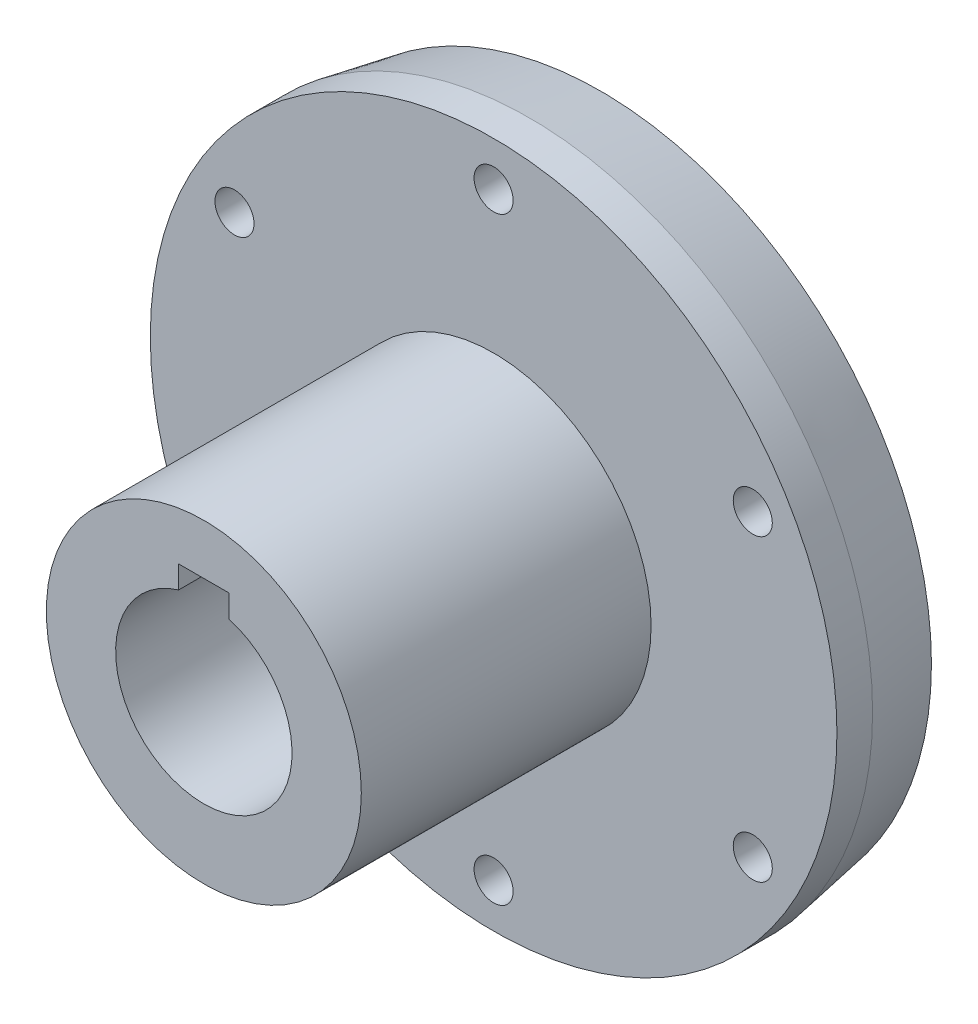
ISO-10303-21;
HEADER;
FILE_DESCRIPTION(('STEP AP214'),'2;1');
FILE_NAME('part.step','',(''),(''),'','','');
FILE_SCHEMA(('AUTOMOTIVE_DESIGN { 1 0 10303 214 1 1 1 1 }'));
ENDSEC;
DATA;
#1=APPLICATION_CONTEXT('core data for automotive mechanical design processes');
#2=APPLICATION_PROTOCOL_DEFINITION('international standard','automotive_design',2000,#1);
#3=PRODUCT_CONTEXT('',#1,'mechanical');
#4=PRODUCT('Part','Part','',(#3));
#5=PRODUCT_RELATED_PRODUCT_CATEGORY('part','',(#4));
#6=PRODUCT_DEFINITION_FORMATION('','',#4);
#7=PRODUCT_DEFINITION_CONTEXT('part definition',#1,'design');
#8=PRODUCT_DEFINITION('design','',#6,#7);
#9=PRODUCT_DEFINITION_SHAPE('','',#8);
#10=(LENGTH_UNIT() NAMED_UNIT(*) SI_UNIT(.MILLI.,.METRE.));
#11=(NAMED_UNIT(*) PLANE_ANGLE_UNIT() SI_UNIT($,.RADIAN.));
#12=(NAMED_UNIT(*) SI_UNIT($,.STERADIAN.) SOLID_ANGLE_UNIT());
#13=UNCERTAINTY_MEASURE_WITH_UNIT(LENGTH_MEASURE(1.E-05),#10,'distance_accuracy_value','');
#14=(GEOMETRIC_REPRESENTATION_CONTEXT(3) GLOBAL_UNCERTAINTY_ASSIGNED_CONTEXT((#13)) GLOBAL_UNIT_ASSIGNED_CONTEXT((#10,
#11,#12)) REPRESENTATION_CONTEXT('',''));
#15=CARTESIAN_POINT('',(0.,0.,0.));
#16=DIRECTION('',(0.,0.,1.));
#17=DIRECTION('',(1.,0.,0.));
#18=AXIS2_PLACEMENT_3D('',#15,#16,#17);
#19=CARTESIAN_POINT('',(0.,0.,17.));
#20=DIRECTION('',(0.,0.,1.));
#21=DIRECTION('',(1.,0.,0.));
#22=AXIS2_PLACEMENT_3D('',#19,#20,#21);
#23=PLANE('',#22);
#24=CARTESIAN_POINT('',(-4.03845944924067E-12,-47.5,17.));
#25=DIRECTION('',(0.,0.,1.));
#26=DIRECTION('',(1.,0.,0.));
#27=AXIS2_PLACEMENT_3D('',#24,#25,#26);
#28=CIRCLE('',#27,3.10000000000418);
#29=CARTESIAN_POINT('',(3.10000000000014,-47.5,17.));
#30=VERTEX_POINT('',#29);
#31=EDGE_CURVE('E234',#30,#30,#28,.T.);
#32=ORIENTED_EDGE('',*,*,#31,.F.);
#33=EDGE_LOOP('',(#32));
#34=FACE_BOUND('',#33,.T.);
#35=CARTESIAN_POINT('',(41.1362066797578,-23.7500000000018,17.));
#36=DIRECTION('',(0.,0.,1.));
#37=DIRECTION('',(1.,0.,0.));
#38=AXIS2_PLACEMENT_3D('',#35,#36,#37);
#39=CIRCLE('',#38,3.10000000000383);
#40=CARTESIAN_POINT('',(44.2362066797616,-23.7500000000018,17.));
#41=VERTEX_POINT('',#40);
#42=EDGE_CURVE('E230',#41,#41,#39,.T.);
#43=ORIENTED_EDGE('',*,*,#42,.F.);
#44=EDGE_LOOP('',(#43));
#45=FACE_BOUND('',#44,.T.);
#46=CARTESIAN_POINT('',(41.1362066797598,23.7499999999982,17.));
#47=DIRECTION('',(0.,0.,1.));
#48=DIRECTION('',(1.,0.,0.));
#49=AXIS2_PLACEMENT_3D('',#46,#47,#48);
#50=CIRCLE('',#49,3.10000000000204);
#51=CARTESIAN_POINT('',(44.2362066797619,23.7499999999982,17.));
#52=VERTEX_POINT('',#51);
#53=EDGE_CURVE('E226',#52,#52,#50,.T.);
#54=ORIENTED_EDGE('',*,*,#53,.F.);
#55=EDGE_LOOP('',(#54));
#56=FACE_BOUND('',#55,.T.);
#57=CARTESIAN_POINT('',(-41.1362066797639,-23.7499999999982,17.));
#58=DIRECTION('',(0.,0.,1.));
#59=DIRECTION('',(1.,0.,0.));
#60=AXIS2_PLACEMENT_3D('',#57,#58,#59);
#61=CIRCLE('',#60,3.10000000000261);
#62=CARTESIAN_POINT('',(-38.0362066797613,-23.7499999999982,17.));
#63=VERTEX_POINT('',#62);
#64=EDGE_CURVE('E222',#63,#63,#61,.T.);
#65=ORIENTED_EDGE('',*,*,#64,.F.);
#66=EDGE_LOOP('',(#65));
#67=FACE_BOUND('',#66,.T.);
#68=CARTESIAN_POINT('',(0.,47.5,17.));
#69=DIRECTION('',(0.,0.,1.));
#70=DIRECTION('',(1.,0.,0.));
#71=AXIS2_PLACEMENT_3D('',#68,#69,#70);
#72=CIRCLE('',#71,3.1);
#73=CARTESIAN_POINT('',(3.1,47.5,17.));
#74=VERTEX_POINT('',#73);
#75=EDGE_CURVE('E218',#74,#74,#72,.T.);
#76=ORIENTED_EDGE('',*,*,#75,.F.);
#77=EDGE_LOOP('',(#76));
#78=FACE_BOUND('',#77,.T.);
#79=CARTESIAN_POINT('',(-41.1362066797618,23.7500000000018,17.));
#80=DIRECTION('',(0.,0.,1.));
#81=DIRECTION('',(1.,0.,0.));
#82=AXIS2_PLACEMENT_3D('',#79,#80,#81);
#83=CIRCLE('',#82,3.10000000000057);
#84=CARTESIAN_POINT('',(-38.0362066797613,23.7500000000018,17.));
#85=VERTEX_POINT('',#84);
#86=EDGE_CURVE('E213',#85,#85,#83,.T.);
#87=ORIENTED_EDGE('',*,*,#86,.F.);
#88=EDGE_LOOP('',(#87));
#89=FACE_BOUND('',#88,.T.);
#90=CARTESIAN_POINT('',(0.,0.,17.));
#91=DIRECTION('',(0.,0.,1.));
#92=DIRECTION('',(1.,0.,0.));
#93=AXIS2_PLACEMENT_3D('',#90,#91,#92);
#94=CIRCLE('',#93,54.5);
#95=CARTESIAN_POINT('',(54.5,0.,17.));
#96=VERTEX_POINT('',#95);
#97=EDGE_CURVE('E142',#96,#96,#94,.T.);
#98=ORIENTED_EDGE('',*,*,#97,.T.);
#99=EDGE_LOOP('',(#98));
#100=FACE_BOUND('',#99,.T.);
#101=CARTESIAN_POINT('',(0.,0.,17.));
#102=DIRECTION('',(0.,0.,1.));
#103=DIRECTION('',(1.,0.,0.));
#104=AXIS2_PLACEMENT_3D('',#101,#102,#103);
#105=CIRCLE('',#104,25.);
#106=CARTESIAN_POINT('',(25.,0.,17.));
#107=VERTEX_POINT('',#106);
#108=EDGE_CURVE('E136',#107,#107,#105,.T.);
#109=ORIENTED_EDGE('',*,*,#108,.F.);
#110=EDGE_LOOP('',(#109));
#111=FACE_BOUND('',#110,.T.);
#112=ADVANCED_FACE('F57',(#34,#45,#56,#67,#78,#89,#100,#111),#23,.T.);
#113=CARTESIAN_POINT('',(0.,0.,17.));
#114=DIRECTION('',(0.,0.,-1.));
#115=DIRECTION('',(-1.,0.,0.));
#116=AXIS2_PLACEMENT_3D('',#113,#114,#115);
#117=CYLINDRICAL_SURFACE('',#116,54.5);
#118=CARTESIAN_POINT('',(0.,0.,11.342563639235));
#119=DIRECTION('',(0.,0.,1.));
#120=DIRECTION('',(1.,0.,0.));
#121=AXIS2_PLACEMENT_3D('',#118,#119,#120);
#122=CIRCLE('',#121,54.5);
#123=CARTESIAN_POINT('',(54.5,0.,11.342563639235));
#124=VERTEX_POINT('',#123);
#125=EDGE_CURVE('E65',#124,#124,#122,.T.);
#126=ORIENTED_EDGE('',*,*,#125,.T.);
#127=EDGE_LOOP('',(#126));
#128=FACE_BOUND('',#127,.T.);
#129=ORIENTED_EDGE('',*,*,#97,.F.);
#130=EDGE_LOOP('',(#129));
#131=FACE_BOUND('',#130,.T.);
#132=ADVANCED_FACE('F152',(#128,#131),#117,.T.);
#133=CARTESIAN_POINT('',(0.,0.,0.));
#134=DIRECTION('',(0.,0.,1.));
#135=DIRECTION('',(1.,0.,0.));
#136=AXIS2_PLACEMENT_3D('',#133,#134,#135);
#137=PLANE('',#136);
#138=CARTESIAN_POINT('',(0.,0.,0.));
#139=DIRECTION('',(0.,0.,1.));
#140=DIRECTION('',(1.,0.,0.));
#141=AXIS2_PLACEMENT_3D('',#138,#139,#140);
#142=CIRCLE('',#141,52.5000000000001);
#143=CARTESIAN_POINT('',(52.5000000000001,0.,0.));
#144=VERTEX_POINT('',#143);
#145=EDGE_CURVE('E14',#144,#144,#142,.F.);
#146=ORIENTED_EDGE('',*,*,#145,.T.);
#147=EDGE_LOOP('',(#146));
#148=FACE_BOUND('',#147,.T.);
#149=CARTESIAN_POINT('',(-4.03845944924067E-12,-47.5,0.));
#150=DIRECTION('',(0.,0.,-1.));
#151=DIRECTION('',(-1.,0.,0.));
#152=AXIS2_PLACEMENT_3D('',#149,#150,#151);
#153=CIRCLE('',#152,3.10000000000418);
#154=CARTESIAN_POINT('',(-3.10000000000822,-47.5,0.));
#155=VERTEX_POINT('',#154);
#156=EDGE_CURVE('E189',#155,#155,#153,.T.);
#157=ORIENTED_EDGE('',*,*,#156,.F.);
#158=EDGE_LOOP('',(#157));
#159=FACE_BOUND('',#158,.T.);
#160=CARTESIAN_POINT('',(41.1362066797578,-23.7500000000018,0.));
#161=DIRECTION('',(0.,0.,-1.));
#162=DIRECTION('',(-1.,0.,0.));
#163=AXIS2_PLACEMENT_3D('',#160,#161,#162);
#164=CIRCLE('',#163,3.10000000000383);
#165=CARTESIAN_POINT('',(38.036206679754,-23.7500000000018,0.));
#166=VERTEX_POINT('',#165);
#167=EDGE_CURVE('E193',#166,#166,#164,.T.);
#168=ORIENTED_EDGE('',*,*,#167,.F.);
#169=EDGE_LOOP('',(#168));
#170=FACE_BOUND('',#169,.T.);
#171=CARTESIAN_POINT('',(41.1362066797598,23.7499999999982,0.));
#172=DIRECTION('',(0.,0.,-1.));
#173=DIRECTION('',(-1.,0.,0.));
#174=AXIS2_PLACEMENT_3D('',#171,#172,#173);
#175=CIRCLE('',#174,3.10000000000204);
#176=CARTESIAN_POINT('',(38.0362066797578,23.7499999999982,0.));
#177=VERTEX_POINT('',#176);
#178=EDGE_CURVE('E197',#177,#177,#175,.T.);
#179=ORIENTED_EDGE('',*,*,#178,.F.);
#180=EDGE_LOOP('',(#179));
#181=FACE_BOUND('',#180,.T.);
#182=CARTESIAN_POINT('',(-41.1362066797639,-23.7499999999982,0.));
#183=DIRECTION('',(0.,0.,-1.));
#184=DIRECTION('',(-1.,0.,0.));
#185=AXIS2_PLACEMENT_3D('',#182,#183,#184);
#186=CIRCLE('',#185,3.10000000000261);
#187=CARTESIAN_POINT('',(-44.2362066797665,-23.7499999999982,0.));
#188=VERTEX_POINT('',#187);
#189=EDGE_CURVE('E201',#188,#188,#186,.T.);
#190=ORIENTED_EDGE('',*,*,#189,.F.);
#191=EDGE_LOOP('',(#190));
#192=FACE_BOUND('',#191,.T.);
#193=CARTESIAN_POINT('',(0.,47.5,0.));
#194=DIRECTION('',(0.,0.,-1.));
#195=DIRECTION('',(-1.,0.,0.));
#196=AXIS2_PLACEMENT_3D('',#193,#194,#195);
#197=CIRCLE('',#196,3.1);
#198=CARTESIAN_POINT('',(-3.1,47.5,0.));
#199=VERTEX_POINT('',#198);
#200=EDGE_CURVE('E205',#199,#199,#197,.T.);
#201=ORIENTED_EDGE('',*,*,#200,.F.);
#202=EDGE_LOOP('',(#201));
#203=FACE_BOUND('',#202,.T.);
#204=CARTESIAN_POINT('',(-41.1362066797618,23.7500000000018,0.));
#205=DIRECTION('',(0.,0.,-1.));
#206=DIRECTION('',(-1.,0.,0.));
#207=AXIS2_PLACEMENT_3D('',#204,#205,#206);
#208=CIRCLE('',#207,3.10000000000057);
#209=CARTESIAN_POINT('',(-44.2362066797624,23.7500000000018,0.));
#210=VERTEX_POINT('',#209);
#211=EDGE_CURVE('E209',#210,#210,#208,.T.);
#212=ORIENTED_EDGE('',*,*,#211,.F.);
#213=EDGE_LOOP('',(#212));
#214=FACE_BOUND('',#213,.T.);
#215=CARTESIAN_POINT('',(0.,0.,0.));
#216=DIRECTION('',(0.,0.,-1.));
#217=DIRECTION('',(-1.,0.,0.));
#218=AXIS2_PLACEMENT_3D('',#215,#216,#217);
#219=CIRCLE('',#218,5.1);
#220=CARTESIAN_POINT('',(-5.1,0.,0.));
#221=VERTEX_POINT('',#220);
#222=EDGE_CURVE('E148',#221,#221,#219,.T.);
#223=ORIENTED_EDGE('',*,*,#222,.F.);
#224=EDGE_LOOP('',(#223));
#225=FACE_BOUND('',#224,.T.);
#226=ADVANCED_FACE('F171',(#148,#159,#170,#181,#192,#203,#214,#225),#137,.F.);
#227=CARTESIAN_POINT('',(0.,0.,63.));
#228=DIRECTION('',(0.,0.,-1.));
#229=DIRECTION('',(-1.,0.,0.));
#230=AXIS2_PLACEMENT_3D('',#227,#228,#229);
#231=CYLINDRICAL_SURFACE('',#230,25.);
#232=CARTESIAN_POINT('',(0.,0.,63.));
#233=DIRECTION('',(0.,0.,1.));
#234=DIRECTION('',(1.,0.,0.));
#235=AXIS2_PLACEMENT_3D('',#232,#233,#234);
#236=CIRCLE('',#235,25.);
#237=CARTESIAN_POINT('',(25.,0.,63.));
#238=VERTEX_POINT('',#237);
#239=EDGE_CURVE('E139',#238,#238,#236,.T.);
#240=ORIENTED_EDGE('',*,*,#239,.F.);
#241=EDGE_LOOP('',(#240));
#242=FACE_BOUND('',#241,.T.);
#243=ORIENTED_EDGE('',*,*,#108,.T.);
#244=EDGE_LOOP('',(#243));
#245=FACE_BOUND('',#244,.T.);
#246=ADVANCED_FACE('F176',(#242,#245),#231,.T.);
#247=CARTESIAN_POINT('',(0.,0.,63.));
#248=DIRECTION('',(0.,0.,1.));
#249=DIRECTION('',(1.,0.,0.));
#250=AXIS2_PLACEMENT_3D('',#247,#248,#249);
#251=PLANE('',#250);
#252=CARTESIAN_POINT('',(0.,0.,63.));
#253=DIRECTION('',(0.,0.,1.));
#254=DIRECTION('',(1.,0.,0.));
#255=AXIS2_PLACEMENT_3D('',#252,#253,#254);
#256=CIRCLE('',#255,14.);
#257=CARTESIAN_POINT('',(-4.,13.4164078649987,63.));
#258=VERTEX_POINT('',#257);
#259=CARTESIAN_POINT('',(4.,13.4164078649987,63.));
#260=VERTEX_POINT('',#259);
#261=EDGE_CURVE('E72',#258,#260,#256,.T.);
#262=ORIENTED_EDGE('',*,*,#261,.F.);
#263=DIRECTION('',(0.,1.,0.));
#264=VECTOR('',#263,1.);
#265=CARTESIAN_POINT('',(-4.,0.,63.));
#266=LINE('',#265,#264);
#267=CARTESIAN_POINT('',(-4.,17.,63.));
#268=VERTEX_POINT('',#267);
#269=EDGE_CURVE('E123',#258,#268,#266,.T.);
#270=ORIENTED_EDGE('',*,*,#269,.T.);
#271=DIRECTION('',(1.,0.,0.));
#272=VECTOR('',#271,1.);
#273=CARTESIAN_POINT('',(0.,17.,63.));
#274=LINE('',#273,#272);
#275=CARTESIAN_POINT('',(4.,17.,63.));
#276=VERTEX_POINT('',#275);
#277=EDGE_CURVE('E131',#268,#276,#274,.T.);
#278=ORIENTED_EDGE('',*,*,#277,.T.);
#279=DIRECTION('',(0.,-1.,0.));
#280=VECTOR('',#279,1.);
#281=CARTESIAN_POINT('',(4.,0.,63.));
#282=LINE('',#281,#280);
#283=EDGE_CURVE('E115',#276,#260,#282,.T.);
#284=ORIENTED_EDGE('',*,*,#283,.T.);
#285=EDGE_LOOP('',(#262,#270,#278,#284));
#286=FACE_BOUND('',#285,.T.);
#287=ORIENTED_EDGE('',*,*,#239,.T.);
#288=EDGE_LOOP('',(#287));
#289=FACE_BOUND('',#288,.T.);
#290=ADVANCED_FACE('F183',(#286,#289),#251,.T.);
#291=CARTESIAN_POINT('',(0.,0.,7.));
#292=DIRECTION('',(0.,0.,1.));
#293=DIRECTION('',(1.,0.,0.));
#294=AXIS2_PLACEMENT_3D('',#291,#292,#293);
#295=CYLINDRICAL_SURFACE('',#294,14.);
#296=ORIENTED_EDGE('',*,*,#261,.T.);
#297=DIRECTION('',(0.,0.,1.));
#298=VECTOR('',#297,1.);
#299=CARTESIAN_POINT('',(4.,13.4164078649987,7.));
#300=LINE('',#299,#298);
#301=CARTESIAN_POINT('',(4.,13.4164078649987,7.));
#302=VERTEX_POINT('',#301);
#303=EDGE_CURVE('E117',#302,#260,#300,.T.);
#304=ORIENTED_EDGE('',*,*,#303,.F.);
#305=CARTESIAN_POINT('',(0.,0.,7.));
#306=DIRECTION('',(0.,0.,1.));
#307=DIRECTION('',(1.,0.,0.));
#308=AXIS2_PLACEMENT_3D('',#305,#306,#307);
#309=CIRCLE('',#308,14.);
#310=CARTESIAN_POINT('',(-4.,13.4164078649987,7.));
#311=VERTEX_POINT('',#310);
#312=EDGE_CURVE('E121',#311,#302,#309,.T.);
#313=ORIENTED_EDGE('',*,*,#312,.F.);
#314=DIRECTION('',(0.,0.,1.));
#315=VECTOR('',#314,1.);
#316=CARTESIAN_POINT('',(-4.,13.4164078649987,7.));
#317=LINE('',#316,#315);
#318=EDGE_CURVE('E80',#311,#258,#317,.T.);
#319=ORIENTED_EDGE('',*,*,#318,.T.);
#320=EDGE_LOOP('',(#296,#304,#313,#319));
#321=FACE_BOUND('',#320,.T.);
#322=ADVANCED_FACE('F271',(#321),#295,.F.);
#323=CARTESIAN_POINT('',(-4.,0.,7.));
#324=DIRECTION('',(1.,0.,0.));
#325=DIRECTION('',(0.,0.,-1.));
#326=AXIS2_PLACEMENT_3D('',#323,#324,#325);
#327=PLANE('',#326);
#328=ORIENTED_EDGE('',*,*,#269,.F.);
#329=ORIENTED_EDGE('',*,*,#318,.F.);
#330=DIRECTION('',(0.,1.,0.));
#331=VECTOR('',#330,1.);
#332=CARTESIAN_POINT('',(-4.,0.,7.));
#333=LINE('',#332,#331);
#334=CARTESIAN_POINT('',(-4.,17.,7.));
#335=VERTEX_POINT('',#334);
#336=EDGE_CURVE('E111',#311,#335,#333,.T.);
#337=ORIENTED_EDGE('',*,*,#336,.T.);
#338=DIRECTION('',(0.,0.,1.));
#339=VECTOR('',#338,1.);
#340=CARTESIAN_POINT('',(-4.,17.,7.));
#341=LINE('',#340,#339);
#342=EDGE_CURVE('E109',#335,#268,#341,.T.);
#343=ORIENTED_EDGE('',*,*,#342,.T.);
#344=EDGE_LOOP('',(#328,#329,#337,#343));
#345=FACE_BOUND('',#344,.T.);
#346=ADVANCED_FACE('F268',(#345),#327,.T.);
#347=CARTESIAN_POINT('',(0.,17.,7.));
#348=DIRECTION('',(0.,-1.,0.));
#349=DIRECTION('',(0.,0.,-1.));
#350=AXIS2_PLACEMENT_3D('',#347,#348,#349);
#351=PLANE('',#350);
#352=ORIENTED_EDGE('',*,*,#277,.F.);
#353=ORIENTED_EDGE('',*,*,#342,.F.);
#354=DIRECTION('',(1.,0.,0.));
#355=VECTOR('',#354,1.);
#356=CARTESIAN_POINT('',(0.,17.,7.));
#357=LINE('',#356,#355);
#358=CARTESIAN_POINT('',(4.,17.,7.));
#359=VERTEX_POINT('',#358);
#360=EDGE_CURVE('E104',#335,#359,#357,.T.);
#361=ORIENTED_EDGE('',*,*,#360,.T.);
#362=DIRECTION('',(0.,0.,1.));
#363=VECTOR('',#362,1.);
#364=CARTESIAN_POINT('',(4.,17.,7.));
#365=LINE('',#364,#363);
#366=EDGE_CURVE('E107',#359,#276,#365,.T.);
#367=ORIENTED_EDGE('',*,*,#366,.T.);
#368=EDGE_LOOP('',(#352,#353,#361,#367));
#369=FACE_BOUND('',#368,.T.);
#370=ADVANCED_FACE('F106',(#369),#351,.T.);
#371=CARTESIAN_POINT('',(4.,0.,7.));
#372=DIRECTION('',(-1.,0.,0.));
#373=DIRECTION('',(0.,0.,1.));
#374=AXIS2_PLACEMENT_3D('',#371,#372,#373);
#375=PLANE('',#374);
#376=ORIENTED_EDGE('',*,*,#283,.F.);
#377=ORIENTED_EDGE('',*,*,#366,.F.);
#378=DIRECTION('',(0.,-1.,0.));
#379=VECTOR('',#378,1.);
#380=CARTESIAN_POINT('',(4.,0.,7.));
#381=LINE('',#380,#379);
#382=EDGE_CURVE('E99',#359,#302,#381,.T.);
#383=ORIENTED_EDGE('',*,*,#382,.T.);
#384=ORIENTED_EDGE('',*,*,#303,.T.);
#385=EDGE_LOOP('',(#376,#377,#383,#384));
#386=FACE_BOUND('',#385,.T.);
#387=ADVANCED_FACE('F113',(#386),#375,.T.);
#388=CARTESIAN_POINT('',(0.,0.,7.));
#389=DIRECTION('',(0.,0.,1.));
#390=DIRECTION('',(1.,0.,0.));
#391=AXIS2_PLACEMENT_3D('',#388,#389,#390);
#392=PLANE('',#391);
#393=CARTESIAN_POINT('',(0.,0.,6.99999999999999));
#394=DIRECTION('',(0.,0.,1.));
#395=DIRECTION('',(1.,0.,0.));
#396=AXIS2_PLACEMENT_3D('',#393,#394,#395);
#397=CIRCLE('',#396,5.1);
#398=CARTESIAN_POINT('',(5.1,0.,6.99999999999999));
#399=VERTEX_POINT('',#398);
#400=EDGE_CURVE('E129',#399,#399,#397,.T.);
#401=ORIENTED_EDGE('',*,*,#400,.F.);
#402=EDGE_LOOP('',(#401));
#403=FACE_BOUND('',#402,.T.);
#404=ORIENTED_EDGE('',*,*,#312,.T.);
#405=ORIENTED_EDGE('',*,*,#382,.F.);
#406=ORIENTED_EDGE('',*,*,#360,.F.);
#407=ORIENTED_EDGE('',*,*,#336,.F.);
#408=EDGE_LOOP('',(#404,#405,#406,#407));
#409=FACE_BOUND('',#408,.T.);
#410=ADVANCED_FACE('F120',(#403,#409),#392,.T.);
#411=CARTESIAN_POINT('',(0.,0.,76.));
#412=DIRECTION('',(0.,0.,-1.));
#413=DIRECTION('',(-1.,0.,0.));
#414=AXIS2_PLACEMENT_3D('',#411,#412,#413);
#415=CYLINDRICAL_SURFACE('',#414,5.1);
#416=ORIENTED_EDGE('',*,*,#400,.T.);
#417=EDGE_LOOP('',(#416));
#418=FACE_BOUND('',#417,.T.);
#419=ORIENTED_EDGE('',*,*,#222,.T.);
#420=EDGE_LOOP('',(#419));
#421=FACE_BOUND('',#420,.T.);
#422=ADVANCED_FACE('F260',(#418,#421),#415,.F.);
#423=CARTESIAN_POINT('',(-41.1362066797618,23.7500000000018,76.));
#424=DIRECTION('',(0.,0.,-1.));
#425=DIRECTION('',(-1.,0.,0.));
#426=AXIS2_PLACEMENT_3D('',#423,#424,#425);
#427=CYLINDRICAL_SURFACE('',#426,3.10000000000057);
#428=ORIENTED_EDGE('',*,*,#86,.T.);
#429=EDGE_LOOP('',(#428));
#430=FACE_BOUND('',#429,.T.);
#431=ORIENTED_EDGE('',*,*,#211,.T.);
#432=EDGE_LOOP('',(#431));
#433=FACE_BOUND('',#432,.T.);
#434=ADVANCED_FACE('F256',(#430,#433),#427,.F.);
#435=CARTESIAN_POINT('',(0.,47.5,76.));
#436=DIRECTION('',(0.,0.,-1.));
#437=DIRECTION('',(-1.,0.,0.));
#438=AXIS2_PLACEMENT_3D('',#435,#436,#437);
#439=CYLINDRICAL_SURFACE('',#438,3.1);
#440=ORIENTED_EDGE('',*,*,#75,.T.);
#441=EDGE_LOOP('',(#440));
#442=FACE_BOUND('',#441,.T.);
#443=ORIENTED_EDGE('',*,*,#200,.T.);
#444=EDGE_LOOP('',(#443));
#445=FACE_BOUND('',#444,.T.);
#446=ADVANCED_FACE('F252',(#442,#445),#439,.F.);
#447=CARTESIAN_POINT('',(-41.1362066797639,-23.7499999999982,76.));
#448=DIRECTION('',(0.,0.,-1.));
#449=DIRECTION('',(-1.,0.,0.));
#450=AXIS2_PLACEMENT_3D('',#447,#448,#449);
#451=CYLINDRICAL_SURFACE('',#450,3.10000000000261);
#452=ORIENTED_EDGE('',*,*,#64,.T.);
#453=EDGE_LOOP('',(#452));
#454=FACE_BOUND('',#453,.T.);
#455=ORIENTED_EDGE('',*,*,#189,.T.);
#456=EDGE_LOOP('',(#455));
#457=FACE_BOUND('',#456,.T.);
#458=ADVANCED_FACE('F246',(#454,#457),#451,.F.);
#459=CARTESIAN_POINT('',(41.1362066797598,23.7499999999982,76.));
#460=DIRECTION('',(0.,0.,-1.));
#461=DIRECTION('',(-1.,0.,0.));
#462=AXIS2_PLACEMENT_3D('',#459,#460,#461);
#463=CYLINDRICAL_SURFACE('',#462,3.10000000000204);
#464=ORIENTED_EDGE('',*,*,#53,.T.);
#465=EDGE_LOOP('',(#464));
#466=FACE_BOUND('',#465,.T.);
#467=ORIENTED_EDGE('',*,*,#178,.T.);
#468=EDGE_LOOP('',(#467));
#469=FACE_BOUND('',#468,.T.);
#470=ADVANCED_FACE('F240',(#466,#469),#463,.F.);
#471=CARTESIAN_POINT('',(41.1362066797578,-23.7500000000018,76.));
#472=DIRECTION('',(0.,0.,-1.));
#473=DIRECTION('',(-1.,0.,0.));
#474=AXIS2_PLACEMENT_3D('',#471,#472,#473);
#475=CYLINDRICAL_SURFACE('',#474,3.10000000000383);
#476=ORIENTED_EDGE('',*,*,#42,.T.);
#477=EDGE_LOOP('',(#476));
#478=FACE_BOUND('',#477,.T.);
#479=ORIENTED_EDGE('',*,*,#167,.T.);
#480=EDGE_LOOP('',(#479));
#481=FACE_BOUND('',#480,.T.);
#482=ADVANCED_FACE('F161',(#478,#481),#475,.F.);
#483=CARTESIAN_POINT('',(-4.03845944924067E-12,-47.5,76.));
#484=DIRECTION('',(0.,0.,-1.));
#485=DIRECTION('',(-1.,0.,0.));
#486=AXIS2_PLACEMENT_3D('',#483,#484,#485);
#487=CYLINDRICAL_SURFACE('',#486,3.10000000000418);
#488=ORIENTED_EDGE('',*,*,#31,.T.);
#489=EDGE_LOOP('',(#488));
#490=FACE_BOUND('',#489,.T.);
#491=ORIENTED_EDGE('',*,*,#156,.T.);
#492=EDGE_LOOP('',(#491));
#493=FACE_BOUND('',#492,.T.);
#494=ADVANCED_FACE('F156',(#490,#493),#487,.F.);
#495=CARTESIAN_POINT('',(0.,0.,11.342563639235));
#496=DIRECTION('',(0.,0.,1.));
#497=DIRECTION('',(1.,0.,0.));
#498=AXIS2_PLACEMENT_3D('',#495,#496,#497);
#499=CONICAL_SURFACE('',#498,54.5,0.174532925199433);
#500=ORIENTED_EDGE('',*,*,#145,.F.);
#501=EDGE_LOOP('',(#500));
#502=FACE_BOUND('',#501,.T.);
#503=ORIENTED_EDGE('',*,*,#125,.F.);
#504=EDGE_LOOP('',(#503));
#505=FACE_BOUND('',#504,.T.);
#506=ADVANCED_FACE('F59',(#502,#505),#499,.T.);
#507=CLOSED_SHELL('',(#112,#132,#226,#246,#290,#322,#346,#370,#387,#410,#422,#434,#446,#458,
#470,#482,#494,#506));
#508=MANIFOLD_SOLID_BREP('B2',#507);
#509=ADVANCED_BREP_SHAPE_REPRESENTATION('',(#18,#508),#14);
#510=SHAPE_DEFINITION_REPRESENTATION(#9,#509);
ENDSEC;
END-ISO-10303-21;
